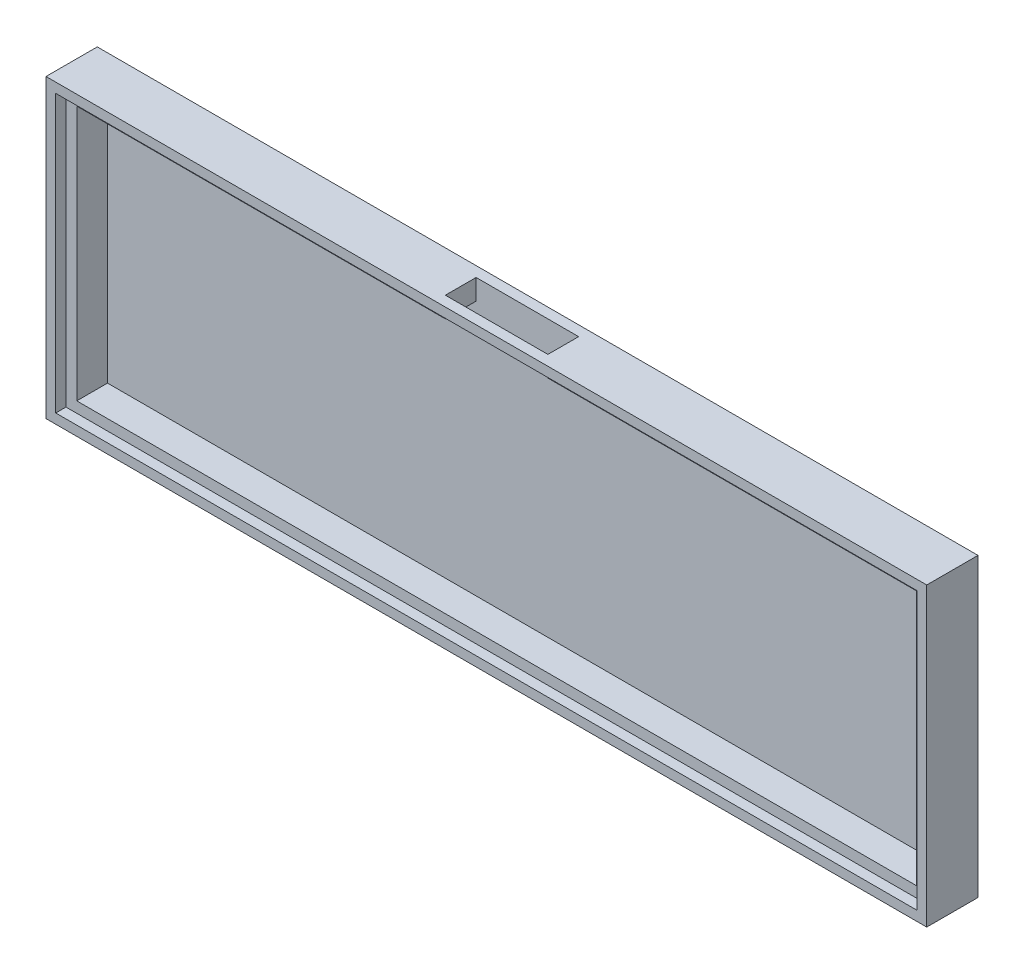
ISO-10303-21;
HEADER;
FILE_DESCRIPTION(('STEP AP214'),'2;1');
FILE_NAME('part.step','',(''),(''),'','','');
FILE_SCHEMA(('AUTOMOTIVE_DESIGN { 1 0 10303 214 1 1 1 1 }'));
ENDSEC;
DATA;
#1=APPLICATION_CONTEXT('core data for automotive mechanical design processes');
#2=APPLICATION_PROTOCOL_DEFINITION('international standard','automotive_design',2000,#1);
#3=PRODUCT_CONTEXT('',#1,'mechanical');
#4=PRODUCT('Part','Part','',(#3));
#5=PRODUCT_RELATED_PRODUCT_CATEGORY('part','',(#4));
#6=PRODUCT_DEFINITION_FORMATION('','',#4);
#7=PRODUCT_DEFINITION_CONTEXT('part definition',#1,'design');
#8=PRODUCT_DEFINITION('design','',#6,#7);
#9=PRODUCT_DEFINITION_SHAPE('','',#8);
#10=(LENGTH_UNIT() NAMED_UNIT(*) SI_UNIT(.MILLI.,.METRE.));
#11=(NAMED_UNIT(*) PLANE_ANGLE_UNIT() SI_UNIT($,.RADIAN.));
#12=(NAMED_UNIT(*) SI_UNIT($,.STERADIAN.) SOLID_ANGLE_UNIT());
#13=UNCERTAINTY_MEASURE_WITH_UNIT(LENGTH_MEASURE(1.E-05),#10,'distance_accuracy_value','');
#14=(GEOMETRIC_REPRESENTATION_CONTEXT(3) GLOBAL_UNCERTAINTY_ASSIGNED_CONTEXT((#13)) GLOBAL_UNIT_ASSIGNED_CONTEXT((#10,
#11,#12)) REPRESENTATION_CONTEXT('',''));
#15=CARTESIAN_POINT('',(0.,0.,0.));
#16=DIRECTION('',(0.,0.,1.));
#17=DIRECTION('',(1.,0.,0.));
#18=AXIS2_PLACEMENT_3D('',#15,#16,#17);
#19=CARTESIAN_POINT('',(167.8,53.8,2.));
#20=DIRECTION('',(0.,1.,0.));
#21=DIRECTION('',(0.,0.,1.));
#22=AXIS2_PLACEMENT_3D('',#19,#20,#21);
#23=PLANE('',#22);
#24=DIRECTION('',(1.,0.,0.));
#25=VECTOR('',#24,1.);
#26=CARTESIAN_POINT('',(167.8,53.8,8.));
#27=LINE('',#26,#25);
#28=CARTESIAN_POINT('',(4.,53.8,8.));
#29=VERTEX_POINT('',#28);
#30=CARTESIAN_POINT('',(75.9,53.8,8.));
#31=VERTEX_POINT('',#30);
#32=EDGE_CURVE('E200',#29,#31,#27,.T.);
#33=ORIENTED_EDGE('',*,*,#32,.F.);
#34=DIRECTION('',(0.,0.,1.));
#35=VECTOR('',#34,1.);
#36=CARTESIAN_POINT('',(4.,53.8,2.));
#37=LINE('',#36,#35);
#38=CARTESIAN_POINT('',(4.,53.8,2.));
#39=VERTEX_POINT('',#38);
#40=EDGE_CURVE('E248',#39,#29,#37,.T.);
#41=ORIENTED_EDGE('',*,*,#40,.F.);
#42=DIRECTION('',(-1.,0.,0.));
#43=VECTOR('',#42,1.);
#44=CARTESIAN_POINT('',(167.8,53.8,2.));
#45=LINE('',#44,#43);
#46=CARTESIAN_POINT('',(75.9,53.8,2.));
#47=VERTEX_POINT('',#46);
#48=EDGE_CURVE('E235',#47,#39,#45,.T.);
#49=ORIENTED_EDGE('',*,*,#48,.F.);
#50=DIRECTION('',(0.,0.,-1.));
#51=VECTOR('',#50,1.);
#52=CARTESIAN_POINT('',(75.9,53.8,2.));
#53=LINE('',#52,#51);
#54=EDGE_CURVE('E211',#31,#47,#53,.T.);
#55=ORIENTED_EDGE('',*,*,#54,.F.);
#56=EDGE_LOOP('',(#33,#41,#49,#55));
#57=FACE_BOUND('',#56,.T.);
#58=ADVANCED_FACE('F39',(#57),#23,.F.);
#59=CARTESIAN_POINT('',(95.9,53.8,8.));
#60=VERTEX_POINT('',#59);
#61=CARTESIAN_POINT('',(167.8,53.8,8.));
#62=VERTEX_POINT('',#61);
#63=EDGE_CURVE('E202',#60,#62,#27,.T.);
#64=ORIENTED_EDGE('',*,*,#63,.F.);
#65=DIRECTION('',(0.,0.,1.));
#66=VECTOR('',#65,1.);
#67=CARTESIAN_POINT('',(95.9,53.8,1.99999999999999));
#68=LINE('',#67,#66);
#69=CARTESIAN_POINT('',(95.9,53.8,1.99999999999999));
#70=VERTEX_POINT('',#69);
#71=EDGE_CURVE('E208',#70,#60,#68,.T.);
#72=ORIENTED_EDGE('',*,*,#71,.F.);
#73=CARTESIAN_POINT('',(167.8,53.8,2.));
#74=VERTEX_POINT('',#73);
#75=EDGE_CURVE('E236',#74,#70,#45,.T.);
#76=ORIENTED_EDGE('',*,*,#75,.F.);
#77=DIRECTION('',(0.,0.,1.));
#78=VECTOR('',#77,1.);
#79=CARTESIAN_POINT('',(167.8,53.8,2.));
#80=LINE('',#79,#78);
#81=EDGE_CURVE('E249',#74,#62,#80,.T.);
#82=ORIENTED_EDGE('',*,*,#81,.T.);
#83=EDGE_LOOP('',(#64,#72,#76,#82));
#84=FACE_BOUND('',#83,.T.);
#85=ADVANCED_FACE('F313',(#84),#23,.F.);
#86=CARTESIAN_POINT('',(167.8,4.,2.));
#87=DIRECTION('',(1.,0.,0.));
#88=DIRECTION('',(0.,0.,-1.));
#89=AXIS2_PLACEMENT_3D('',#86,#87,#88);
#90=PLANE('',#89);
#91=DIRECTION('',(0.,-1.,0.));
#92=VECTOR('',#91,1.);
#93=CARTESIAN_POINT('',(167.8,4.,8.));
#94=LINE('',#93,#92);
#95=CARTESIAN_POINT('',(167.8,4.,8.));
#96=VERTEX_POINT('',#95);
#97=EDGE_CURVE('E206',#62,#96,#94,.T.);
#98=ORIENTED_EDGE('',*,*,#97,.F.);
#99=ORIENTED_EDGE('',*,*,#81,.F.);
#100=DIRECTION('',(0.,1.,0.));
#101=VECTOR('',#100,1.);
#102=CARTESIAN_POINT('',(167.8,4.,2.));
#103=LINE('',#102,#101);
#104=CARTESIAN_POINT('',(167.8,4.,2.));
#105=VERTEX_POINT('',#104);
#106=EDGE_CURVE('E245',#105,#74,#103,.T.);
#107=ORIENTED_EDGE('',*,*,#106,.F.);
#108=DIRECTION('',(0.,0.,1.));
#109=VECTOR('',#108,1.);
#110=CARTESIAN_POINT('',(167.8,4.,2.));
#111=LINE('',#110,#109);
#112=EDGE_CURVE('E253',#105,#96,#111,.T.);
#113=ORIENTED_EDGE('',*,*,#112,.T.);
#114=EDGE_LOOP('',(#98,#99,#107,#113));
#115=FACE_BOUND('',#114,.T.);
#116=ADVANCED_FACE('F320',(#115),#90,.F.);
#117=CARTESIAN_POINT('',(4.,4.,2.));
#118=DIRECTION('',(0.,-1.,0.));
#119=DIRECTION('',(0.,0.,-1.));
#120=AXIS2_PLACEMENT_3D('',#117,#118,#119);
#121=PLANE('',#120);
#122=DIRECTION('',(-1.,0.,0.));
#123=VECTOR('',#122,1.);
#124=CARTESIAN_POINT('',(4.,4.,8.));
#125=LINE('',#124,#123);
#126=CARTESIAN_POINT('',(4.,4.,8.));
#127=VERTEX_POINT('',#126);
#128=EDGE_CURVE('E204',#96,#127,#125,.T.);
#129=ORIENTED_EDGE('',*,*,#128,.F.);
#130=ORIENTED_EDGE('',*,*,#112,.F.);
#131=DIRECTION('',(1.,0.,0.));
#132=VECTOR('',#131,1.);
#133=CARTESIAN_POINT('',(4.,4.,2.));
#134=LINE('',#133,#132);
#135=CARTESIAN_POINT('',(4.,4.,2.));
#136=VERTEX_POINT('',#135);
#137=EDGE_CURVE('E242',#136,#105,#134,.T.);
#138=ORIENTED_EDGE('',*,*,#137,.F.);
#139=DIRECTION('',(0.,0.,1.));
#140=VECTOR('',#139,1.);
#141=CARTESIAN_POINT('',(4.,4.,2.));
#142=LINE('',#141,#140);
#143=EDGE_CURVE('E256',#136,#127,#142,.T.);
#144=ORIENTED_EDGE('',*,*,#143,.T.);
#145=EDGE_LOOP('',(#129,#130,#138,#144));
#146=FACE_BOUND('',#145,.T.);
#147=ADVANCED_FACE('F337',(#146),#121,.F.);
#148=CARTESIAN_POINT('',(4.,53.8,2.));
#149=DIRECTION('',(-1.,0.,0.));
#150=DIRECTION('',(0.,0.,1.));
#151=AXIS2_PLACEMENT_3D('',#148,#149,#150);
#152=PLANE('',#151);
#153=DIRECTION('',(0.,1.,0.));
#154=VECTOR('',#153,1.);
#155=CARTESIAN_POINT('',(4.,53.8,8.));
#156=LINE('',#155,#154);
#157=EDGE_CURVE('E196',#127,#29,#156,.T.);
#158=ORIENTED_EDGE('',*,*,#157,.F.);
#159=ORIENTED_EDGE('',*,*,#143,.F.);
#160=DIRECTION('',(0.,-1.,0.));
#161=VECTOR('',#160,1.);
#162=CARTESIAN_POINT('',(4.,53.8,2.));
#163=LINE('',#162,#161);
#164=EDGE_CURVE('E239',#39,#136,#163,.T.);
#165=ORIENTED_EDGE('',*,*,#164,.F.);
#166=ORIENTED_EDGE('',*,*,#40,.T.);
#167=EDGE_LOOP('',(#158,#159,#165,#166));
#168=FACE_BOUND('',#167,.T.);
#169=ADVANCED_FACE('F325',(#168),#152,.F.);
#170=CARTESIAN_POINT('',(0.,57.8,10.));
#171=DIRECTION('',(0.,-1.,0.));
#172=DIRECTION('',(0.,0.,-1.));
#173=AXIS2_PLACEMENT_3D('',#170,#171,#172);
#174=PLANE('',#173);
#175=DIRECTION('',(-1.,0.,0.));
#176=VECTOR('',#175,1.);
#177=CARTESIAN_POINT('',(0.,57.8,0.));
#178=LINE('',#177,#176);
#179=CARTESIAN_POINT('',(171.8,57.8,0.));
#180=VERTEX_POINT('',#179);
#181=CARTESIAN_POINT('',(0.,57.8,0.));
#182=VERTEX_POINT('',#181);
#183=EDGE_CURVE('E265',#180,#182,#178,.T.);
#184=ORIENTED_EDGE('',*,*,#183,.T.);
#185=DIRECTION('',(0.,0.,-1.));
#186=VECTOR('',#185,1.);
#187=CARTESIAN_POINT('',(0.,57.8,10.));
#188=LINE('',#187,#186);
#189=CARTESIAN_POINT('',(0.,57.8,10.));
#190=VERTEX_POINT('',#189);
#191=EDGE_CURVE('E271',#190,#182,#188,.T.);
#192=ORIENTED_EDGE('',*,*,#191,.F.);
#193=DIRECTION('',(-1.,0.,0.));
#194=VECTOR('',#193,1.);
#195=CARTESIAN_POINT('',(0.,57.8,10.));
#196=LINE('',#195,#194);
#197=CARTESIAN_POINT('',(171.8,57.8,10.));
#198=VERTEX_POINT('',#197);
#199=EDGE_CURVE('E269',#198,#190,#196,.T.);
#200=ORIENTED_EDGE('',*,*,#199,.F.);
#201=DIRECTION('',(0.,0.,-1.));
#202=VECTOR('',#201,1.);
#203=CARTESIAN_POINT('',(171.8,57.8,10.));
#204=LINE('',#203,#202);
#205=EDGE_CURVE('E281',#198,#180,#204,.T.);
#206=ORIENTED_EDGE('',*,*,#205,.T.);
#207=EDGE_LOOP('',(#184,#192,#200,#206));
#208=FACE_BOUND('',#207,.T.);
#209=DIRECTION('',(1.,0.,0.));
#210=VECTOR('',#209,1.);
#211=CARTESIAN_POINT('',(75.9,57.8,2.));
#212=LINE('',#211,#210);
#213=CARTESIAN_POINT('',(75.9,57.8,2.));
#214=VERTEX_POINT('',#213);
#215=CARTESIAN_POINT('',(95.9,57.8,1.99999999999999));
#216=VERTEX_POINT('',#215);
#217=EDGE_CURVE('E62',#214,#216,#212,.T.);
#218=ORIENTED_EDGE('',*,*,#217,.T.);
#219=DIRECTION('',(0.,0.,1.));
#220=VECTOR('',#219,1.);
#221=CARTESIAN_POINT('',(95.9,57.8,1.99999999999999));
#222=LINE('',#221,#220);
#223=CARTESIAN_POINT('',(95.9,57.8,7.99999999999999));
#224=VERTEX_POINT('',#223);
#225=EDGE_CURVE('E217',#216,#224,#222,.T.);
#226=ORIENTED_EDGE('',*,*,#225,.T.);
#227=DIRECTION('',(-1.,0.,0.));
#228=VECTOR('',#227,1.);
#229=CARTESIAN_POINT('',(75.9,57.8,8.));
#230=LINE('',#229,#228);
#231=CARTESIAN_POINT('',(75.9,57.8,8.));
#232=VERTEX_POINT('',#231);
#233=EDGE_CURVE('E220',#224,#232,#230,.T.);
#234=ORIENTED_EDGE('',*,*,#233,.T.);
#235=DIRECTION('',(0.,0.,-1.));
#236=VECTOR('',#235,1.);
#237=CARTESIAN_POINT('',(75.9,57.8,2.));
#238=LINE('',#237,#236);
#239=EDGE_CURVE('E212',#232,#214,#238,.T.);
#240=ORIENTED_EDGE('',*,*,#239,.T.);
#241=EDGE_LOOP('',(#218,#226,#234,#240));
#242=FACE_BOUND('',#241,.T.);
#243=ADVANCED_FACE('F297',(#208,#242),#174,.F.);
#244=CARTESIAN_POINT('',(0.,0.,10.));
#245=DIRECTION('',(1.,0.,0.));
#246=DIRECTION('',(0.,0.,-1.));
#247=AXIS2_PLACEMENT_3D('',#244,#245,#246);
#248=PLANE('',#247);
#249=DIRECTION('',(0.,-1.,0.));
#250=VECTOR('',#249,1.);
#251=CARTESIAN_POINT('',(0.,0.,0.));
#252=LINE('',#251,#250);
#253=CARTESIAN_POINT('',(0.,0.,0.));
#254=VERTEX_POINT('',#253);
#255=EDGE_CURVE('E252',#182,#254,#252,.T.);
#256=ORIENTED_EDGE('',*,*,#255,.T.);
#257=DIRECTION('',(0.,0.,-1.));
#258=VECTOR('',#257,1.);
#259=CARTESIAN_POINT('',(0.,0.,10.));
#260=LINE('',#259,#258);
#261=CARTESIAN_POINT('',(0.,0.,10.));
#262=VERTEX_POINT('',#261);
#263=EDGE_CURVE('E11',#262,#254,#260,.T.);
#264=ORIENTED_EDGE('',*,*,#263,.F.);
#265=DIRECTION('',(0.,-1.,0.));
#266=VECTOR('',#265,1.);
#267=CARTESIAN_POINT('',(0.,0.,10.));
#268=LINE('',#267,#266);
#269=EDGE_CURVE('E261',#190,#262,#268,.T.);
#270=ORIENTED_EDGE('',*,*,#269,.F.);
#271=ORIENTED_EDGE('',*,*,#191,.T.);
#272=EDGE_LOOP('',(#256,#264,#270,#271));
#273=FACE_BOUND('',#272,.T.);
#274=ADVANCED_FACE('F41',(#273),#248,.F.);
#275=CARTESIAN_POINT('',(0.,0.,10.));
#276=DIRECTION('',(0.,1.,0.));
#277=DIRECTION('',(0.,0.,1.));
#278=AXIS2_PLACEMENT_3D('',#275,#276,#277);
#279=PLANE('',#278);
#280=DIRECTION('',(1.,0.,0.));
#281=VECTOR('',#280,1.);
#282=CARTESIAN_POINT('',(0.,0.,0.));
#283=LINE('',#282,#281);
#284=CARTESIAN_POINT('',(171.8,0.,0.));
#285=VERTEX_POINT('',#284);
#286=EDGE_CURVE('E274',#254,#285,#283,.T.);
#287=ORIENTED_EDGE('',*,*,#286,.T.);
#288=DIRECTION('',(0.,0.,-1.));
#289=VECTOR('',#288,1.);
#290=CARTESIAN_POINT('',(171.8,0.,10.));
#291=LINE('',#290,#289);
#292=CARTESIAN_POINT('',(171.8,0.,10.));
#293=VERTEX_POINT('',#292);
#294=EDGE_CURVE('E47',#293,#285,#291,.T.);
#295=ORIENTED_EDGE('',*,*,#294,.F.);
#296=DIRECTION('',(1.,0.,0.));
#297=VECTOR('',#296,1.);
#298=CARTESIAN_POINT('',(0.,0.,10.));
#299=LINE('',#298,#297);
#300=EDGE_CURVE('E264',#262,#293,#299,.T.);
#301=ORIENTED_EDGE('',*,*,#300,.F.);
#302=ORIENTED_EDGE('',*,*,#263,.T.);
#303=EDGE_LOOP('',(#287,#295,#301,#302));
#304=FACE_BOUND('',#303,.T.);
#305=ADVANCED_FACE('F305',(#304),#279,.F.);
#306=CARTESIAN_POINT('',(171.8,0.,10.));
#307=DIRECTION('',(-1.,0.,0.));
#308=DIRECTION('',(0.,0.,1.));
#309=AXIS2_PLACEMENT_3D('',#306,#307,#308);
#310=PLANE('',#309);
#311=DIRECTION('',(0.,1.,0.));
#312=VECTOR('',#311,1.);
#313=CARTESIAN_POINT('',(171.8,0.,0.));
#314=LINE('',#313,#312);
#315=EDGE_CURVE('E276',#285,#180,#314,.T.);
#316=ORIENTED_EDGE('',*,*,#315,.T.);
#317=ORIENTED_EDGE('',*,*,#205,.F.);
#318=DIRECTION('',(0.,1.,0.));
#319=VECTOR('',#318,1.);
#320=CARTESIAN_POINT('',(171.8,0.,10.));
#321=LINE('',#320,#319);
#322=EDGE_CURVE('E267',#293,#198,#321,.T.);
#323=ORIENTED_EDGE('',*,*,#322,.F.);
#324=ORIENTED_EDGE('',*,*,#294,.T.);
#325=EDGE_LOOP('',(#316,#317,#323,#324));
#326=FACE_BOUND('',#325,.T.);
#327=ADVANCED_FACE('F288',(#326),#310,.F.);
#328=CARTESIAN_POINT('',(0.,0.,10.));
#329=DIRECTION('',(0.,0.,-1.));
#330=DIRECTION('',(-1.,0.,0.));
#331=AXIS2_PLACEMENT_3D('',#328,#329,#330);
#332=PLANE('',#331);
#333=DIRECTION('',(0.,1.,0.));
#334=VECTOR('',#333,1.);
#335=CARTESIAN_POINT('',(169.9,1.9,10.));
#336=LINE('',#335,#334);
#337=CARTESIAN_POINT('',(169.9,1.9,10.));
#338=VERTEX_POINT('',#337);
#339=CARTESIAN_POINT('',(169.9,55.9,10.));
#340=VERTEX_POINT('',#339);
#341=EDGE_CURVE('E190',#338,#340,#336,.T.);
#342=ORIENTED_EDGE('',*,*,#341,.F.);
#343=DIRECTION('',(1.,0.,0.));
#344=VECTOR('',#343,1.);
#345=CARTESIAN_POINT('',(1.9,1.9,10.));
#346=LINE('',#345,#344);
#347=CARTESIAN_POINT('',(1.9,1.9,10.));
#348=VERTEX_POINT('',#347);
#349=EDGE_CURVE('E54',#348,#338,#346,.T.);
#350=ORIENTED_EDGE('',*,*,#349,.F.);
#351=DIRECTION('',(0.,-1.,0.));
#352=VECTOR('',#351,1.);
#353=CARTESIAN_POINT('',(1.9,55.9,10.));
#354=LINE('',#353,#352);
#355=CARTESIAN_POINT('',(1.9,55.9,10.));
#356=VERTEX_POINT('',#355);
#357=EDGE_CURVE('E179',#356,#348,#354,.T.);
#358=ORIENTED_EDGE('',*,*,#357,.F.);
#359=DIRECTION('',(-1.,0.,0.));
#360=VECTOR('',#359,1.);
#361=CARTESIAN_POINT('',(169.9,55.9,10.));
#362=LINE('',#361,#360);
#363=EDGE_CURVE('E182',#340,#356,#362,.T.);
#364=ORIENTED_EDGE('',*,*,#363,.F.);
#365=EDGE_LOOP('',(#342,#350,#358,#364));
#366=FACE_BOUND('',#365,.T.);
#367=ORIENTED_EDGE('',*,*,#269,.T.);
#368=ORIENTED_EDGE('',*,*,#300,.T.);
#369=ORIENTED_EDGE('',*,*,#322,.T.);
#370=ORIENTED_EDGE('',*,*,#199,.T.);
#371=EDGE_LOOP('',(#367,#368,#369,#370));
#372=FACE_BOUND('',#371,.T.);
#373=ADVANCED_FACE('F304',(#366,#372),#332,.F.);
#374=CARTESIAN_POINT('',(0.,0.,0.));
#375=DIRECTION('',(0.,0.,-1.));
#376=DIRECTION('',(-1.,0.,0.));
#377=AXIS2_PLACEMENT_3D('',#374,#375,#376);
#378=PLANE('',#377);
#379=ORIENTED_EDGE('',*,*,#255,.F.);
#380=ORIENTED_EDGE('',*,*,#183,.F.);
#381=ORIENTED_EDGE('',*,*,#315,.F.);
#382=ORIENTED_EDGE('',*,*,#286,.F.);
#383=EDGE_LOOP('',(#379,#380,#381,#382));
#384=FACE_BOUND('',#383,.T.);
#385=ADVANCED_FACE('F294',(#384),#378,.T.);
#386=CARTESIAN_POINT('',(0.,0.,2.));
#387=DIRECTION('',(0.,0.,1.));
#388=DIRECTION('',(1.,0.,0.));
#389=AXIS2_PLACEMENT_3D('',#386,#387,#388);
#390=PLANE('',#389);
#391=ORIENTED_EDGE('',*,*,#75,.T.);
#392=DIRECTION('',(0.,1.,0.));
#393=VECTOR('',#392,1.);
#394=CARTESIAN_POINT('',(95.9,53.8,1.99999999999999));
#395=LINE('',#394,#393);
#396=EDGE_CURVE('E233',#70,#216,#395,.T.);
#397=ORIENTED_EDGE('',*,*,#396,.T.);
#398=ORIENTED_EDGE('',*,*,#217,.F.);
#399=DIRECTION('',(0.,1.,0.));
#400=VECTOR('',#399,1.);
#401=CARTESIAN_POINT('',(75.9,53.8,2.));
#402=LINE('',#401,#400);
#403=EDGE_CURVE('E215',#47,#214,#402,.T.);
#404=ORIENTED_EDGE('',*,*,#403,.F.);
#405=ORIENTED_EDGE('',*,*,#48,.T.);
#406=ORIENTED_EDGE('',*,*,#164,.T.);
#407=ORIENTED_EDGE('',*,*,#137,.T.);
#408=ORIENTED_EDGE('',*,*,#106,.T.);
#409=EDGE_LOOP('',(#391,#397,#398,#404,#405,#406,#407,#408));
#410=FACE_BOUND('',#409,.T.);
#411=ADVANCED_FACE('F332',(#410),#390,.T.);
#412=CARTESIAN_POINT('',(95.9,53.8,1.99999999999999));
#413=DIRECTION('',(-1.,0.,0.));
#414=DIRECTION('',(0.,0.,1.));
#415=AXIS2_PLACEMENT_3D('',#412,#413,#414);
#416=PLANE('',#415);
#417=ORIENTED_EDGE('',*,*,#225,.F.);
#418=ORIENTED_EDGE('',*,*,#396,.F.);
#419=ORIENTED_EDGE('',*,*,#71,.T.);
#420=DIRECTION('',(0.,1.,0.));
#421=VECTOR('',#420,1.);
#422=CARTESIAN_POINT('',(95.9,53.8,7.99999999999999));
#423=LINE('',#422,#421);
#424=CARTESIAN_POINT('',(95.9,55.9,8.));
#425=VERTEX_POINT('',#424);
#426=EDGE_CURVE('E230',#60,#425,#423,.T.);
#427=ORIENTED_EDGE('',*,*,#426,.T.);
#428=EDGE_CURVE('E229',#425,#224,#423,.T.);
#429=ORIENTED_EDGE('',*,*,#428,.T.);
#430=EDGE_LOOP('',(#417,#418,#419,#427,#429));
#431=FACE_BOUND('',#430,.T.);
#432=ADVANCED_FACE('F385',(#431),#416,.T.);
#433=CARTESIAN_POINT('',(75.9,53.8,8.));
#434=DIRECTION('',(0.,0.,-1.));
#435=DIRECTION('',(-1.,0.,0.));
#436=AXIS2_PLACEMENT_3D('',#433,#434,#435);
#437=PLANE('',#436);
#438=DIRECTION('',(-1.,0.,0.));
#439=VECTOR('',#438,1.);
#440=CARTESIAN_POINT('',(169.9,55.9,8.));
#441=LINE('',#440,#439);
#442=CARTESIAN_POINT('',(75.9,55.9,8.));
#443=VERTEX_POINT('',#442);
#444=EDGE_CURVE('E187',#425,#443,#441,.T.);
#445=ORIENTED_EDGE('',*,*,#444,.T.);
#446=DIRECTION('',(0.,1.,0.));
#447=VECTOR('',#446,1.);
#448=CARTESIAN_POINT('',(75.9,53.8,8.));
#449=LINE('',#448,#447);
#450=EDGE_CURVE('E226',#443,#232,#449,.T.);
#451=ORIENTED_EDGE('',*,*,#450,.T.);
#452=ORIENTED_EDGE('',*,*,#233,.F.);
#453=ORIENTED_EDGE('',*,*,#428,.F.);
#454=EDGE_LOOP('',(#445,#451,#452,#453));
#455=FACE_BOUND('',#454,.T.);
#456=ADVANCED_FACE('F360',(#455),#437,.T.);
#457=CARTESIAN_POINT('',(75.9,53.8,2.));
#458=DIRECTION('',(1.,0.,0.));
#459=DIRECTION('',(0.,0.,-1.));
#460=AXIS2_PLACEMENT_3D('',#457,#458,#459);
#461=PLANE('',#460);
#462=ORIENTED_EDGE('',*,*,#239,.F.);
#463=ORIENTED_EDGE('',*,*,#450,.F.);
#464=EDGE_CURVE('E227',#31,#443,#449,.T.);
#465=ORIENTED_EDGE('',*,*,#464,.F.);
#466=ORIENTED_EDGE('',*,*,#54,.T.);
#467=ORIENTED_EDGE('',*,*,#403,.T.);
#468=EDGE_LOOP('',(#462,#463,#465,#466,#467));
#469=FACE_BOUND('',#468,.T.);
#470=ADVANCED_FACE('F356',(#469),#461,.T.);
#471=CARTESIAN_POINT('',(0.,0.,8.));
#472=DIRECTION('',(0.,0.,1.));
#473=DIRECTION('',(1.,0.,0.));
#474=AXIS2_PLACEMENT_3D('',#471,#472,#473);
#475=PLANE('',#474);
#476=ORIENTED_EDGE('',*,*,#32,.T.);
#477=ORIENTED_EDGE('',*,*,#464,.T.);
#478=CARTESIAN_POINT('',(1.9,55.9,8.));
#479=VERTEX_POINT('',#478);
#480=EDGE_CURVE('E175',#443,#479,#441,.T.);
#481=ORIENTED_EDGE('',*,*,#480,.T.);
#482=DIRECTION('',(0.,-1.,0.));
#483=VECTOR('',#482,1.);
#484=CARTESIAN_POINT('',(1.9,55.9,8.));
#485=LINE('',#484,#483);
#486=CARTESIAN_POINT('',(1.9,1.9,8.));
#487=VERTEX_POINT('',#486);
#488=EDGE_CURVE('E167',#479,#487,#485,.T.);
#489=ORIENTED_EDGE('',*,*,#488,.T.);
#490=DIRECTION('',(1.,0.,0.));
#491=VECTOR('',#490,1.);
#492=CARTESIAN_POINT('',(1.9,1.9,8.));
#493=LINE('',#492,#491);
#494=CARTESIAN_POINT('',(169.9,1.9,8.));
#495=VERTEX_POINT('',#494);
#496=EDGE_CURVE('E161',#487,#495,#493,.T.);
#497=ORIENTED_EDGE('',*,*,#496,.T.);
#498=DIRECTION('',(0.,1.,0.));
#499=VECTOR('',#498,1.);
#500=CARTESIAN_POINT('',(169.9,1.9,8.));
#501=LINE('',#500,#499);
#502=CARTESIAN_POINT('',(169.9,55.9,8.));
#503=VERTEX_POINT('',#502);
#504=EDGE_CURVE('E170',#495,#503,#501,.T.);
#505=ORIENTED_EDGE('',*,*,#504,.T.);
#506=EDGE_CURVE('E185',#503,#425,#441,.T.);
#507=ORIENTED_EDGE('',*,*,#506,.T.);
#508=ORIENTED_EDGE('',*,*,#426,.F.);
#509=ORIENTED_EDGE('',*,*,#63,.T.);
#510=ORIENTED_EDGE('',*,*,#97,.T.);
#511=ORIENTED_EDGE('',*,*,#128,.T.);
#512=ORIENTED_EDGE('',*,*,#157,.T.);
#513=EDGE_LOOP('',(#476,#477,#481,#489,#497,#505,#507,#508,#509,#510,#511,#512));
#514=FACE_BOUND('',#513,.T.);
#515=ADVANCED_FACE('F177',(#514),#475,.T.);
#516=CARTESIAN_POINT('',(1.9,1.9,8.));
#517=DIRECTION('',(0.,-1.,0.));
#518=DIRECTION('',(0.,0.,-1.));
#519=AXIS2_PLACEMENT_3D('',#516,#517,#518);
#520=PLANE('',#519);
#521=ORIENTED_EDGE('',*,*,#349,.T.);
#522=DIRECTION('',(0.,0.,1.));
#523=VECTOR('',#522,1.);
#524=CARTESIAN_POINT('',(169.9,1.9,8.));
#525=LINE('',#524,#523);
#526=EDGE_CURVE('E157',#495,#338,#525,.T.);
#527=ORIENTED_EDGE('',*,*,#526,.F.);
#528=ORIENTED_EDGE('',*,*,#496,.F.);
#529=DIRECTION('',(0.,0.,1.));
#530=VECTOR('',#529,1.);
#531=CARTESIAN_POINT('',(1.9,1.9,8.));
#532=LINE('',#531,#530);
#533=EDGE_CURVE('E194',#487,#348,#532,.T.);
#534=ORIENTED_EDGE('',*,*,#533,.T.);
#535=EDGE_LOOP('',(#521,#527,#528,#534));
#536=FACE_BOUND('',#535,.T.);
#537=ADVANCED_FACE('F159',(#536),#520,.F.);
#538=CARTESIAN_POINT('',(1.9,55.9,8.));
#539=DIRECTION('',(-1.,0.,0.));
#540=DIRECTION('',(0.,0.,1.));
#541=AXIS2_PLACEMENT_3D('',#538,#539,#540);
#542=PLANE('',#541);
#543=ORIENTED_EDGE('',*,*,#357,.T.);
#544=ORIENTED_EDGE('',*,*,#533,.F.);
#545=ORIENTED_EDGE('',*,*,#488,.F.);
#546=DIRECTION('',(0.,0.,1.));
#547=VECTOR('',#546,1.);
#548=CARTESIAN_POINT('',(1.9,55.9,8.));
#549=LINE('',#548,#547);
#550=EDGE_CURVE('E197',#479,#356,#549,.T.);
#551=ORIENTED_EDGE('',*,*,#550,.T.);
#552=EDGE_LOOP('',(#543,#544,#545,#551));
#553=FACE_BOUND('',#552,.T.);
#554=ADVANCED_FACE('F368',(#553),#542,.F.);
#555=CARTESIAN_POINT('',(169.9,55.9,8.));
#556=DIRECTION('',(0.,1.,0.));
#557=DIRECTION('',(0.,0.,1.));
#558=AXIS2_PLACEMENT_3D('',#555,#556,#557);
#559=PLANE('',#558);
#560=ORIENTED_EDGE('',*,*,#363,.T.);
#561=ORIENTED_EDGE('',*,*,#550,.F.);
#562=ORIENTED_EDGE('',*,*,#480,.F.);
#563=ORIENTED_EDGE('',*,*,#444,.F.);
#564=ORIENTED_EDGE('',*,*,#506,.F.);
#565=DIRECTION('',(0.,0.,1.));
#566=VECTOR('',#565,1.);
#567=CARTESIAN_POINT('',(169.9,55.9,8.));
#568=LINE('',#567,#566);
#569=EDGE_CURVE('E166',#503,#340,#568,.T.);
#570=ORIENTED_EDGE('',*,*,#569,.T.);
#571=EDGE_LOOP('',(#560,#561,#562,#563,#564,#570));
#572=FACE_BOUND('',#571,.T.);
#573=ADVANCED_FACE('F364',(#572),#559,.F.);
#574=CARTESIAN_POINT('',(169.9,1.9,8.));
#575=DIRECTION('',(1.,0.,0.));
#576=DIRECTION('',(0.,0.,-1.));
#577=AXIS2_PLACEMENT_3D('',#574,#575,#576);
#578=PLANE('',#577);
#579=ORIENTED_EDGE('',*,*,#341,.T.);
#580=ORIENTED_EDGE('',*,*,#569,.F.);
#581=ORIENTED_EDGE('',*,*,#504,.F.);
#582=ORIENTED_EDGE('',*,*,#526,.T.);
#583=EDGE_LOOP('',(#579,#580,#581,#582));
#584=FACE_BOUND('',#583,.T.);
#585=ADVANCED_FACE('F171',(#584),#578,.F.);
#586=CLOSED_SHELL('',(#58,#85,#116,#147,#169,#243,#274,#305,#327,#373,#385,#411,#432,#456,#470,
#515,#537,#554,#573,#585));
#587=MANIFOLD_SOLID_BREP('B2',#586);
#588=ADVANCED_BREP_SHAPE_REPRESENTATION('',(#18,#587),#14);
#589=SHAPE_DEFINITION_REPRESENTATION(#9,#588);
ENDSEC;
END-ISO-10303-21;
